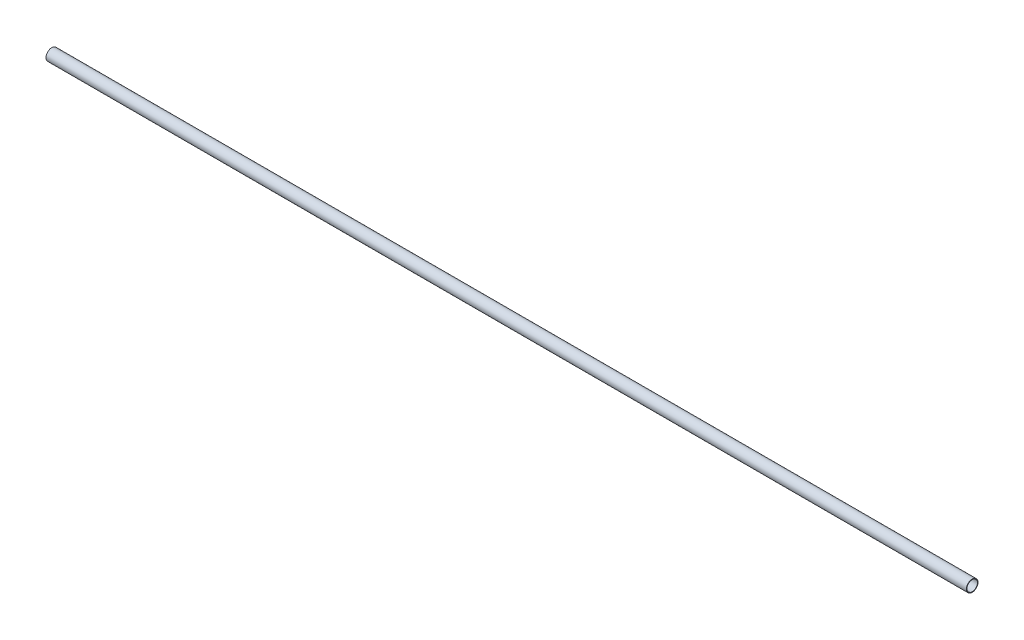
ISO-10303-21;
HEADER;
FILE_DESCRIPTION(('STEP AP214'),'2;1');
FILE_NAME('part.step','',(''),(''),'','','');
FILE_SCHEMA(('AUTOMOTIVE_DESIGN { 1 0 10303 214 1 1 1 1 }'));
ENDSEC;
DATA;
#1=APPLICATION_CONTEXT('core data for automotive mechanical design processes');
#2=APPLICATION_PROTOCOL_DEFINITION('international standard','automotive_design',2000,#1);
#3=PRODUCT_CONTEXT('',#1,'mechanical');
#4=PRODUCT('Part','Part','',(#3));
#5=PRODUCT_RELATED_PRODUCT_CATEGORY('part','',(#4));
#6=PRODUCT_DEFINITION_FORMATION('','',#4);
#7=PRODUCT_DEFINITION_CONTEXT('part definition',#1,'design');
#8=PRODUCT_DEFINITION('design','',#6,#7);
#9=PRODUCT_DEFINITION_SHAPE('','',#8);
#10=(LENGTH_UNIT() NAMED_UNIT(*) SI_UNIT(.MILLI.,.METRE.));
#11=(NAMED_UNIT(*) PLANE_ANGLE_UNIT() SI_UNIT($,.RADIAN.));
#12=(NAMED_UNIT(*) SI_UNIT($,.STERADIAN.) SOLID_ANGLE_UNIT());
#13=UNCERTAINTY_MEASURE_WITH_UNIT(LENGTH_MEASURE(1.E-05),#10,'distance_accuracy_value','');
#14=(GEOMETRIC_REPRESENTATION_CONTEXT(3) GLOBAL_UNCERTAINTY_ASSIGNED_CONTEXT((#13)) GLOBAL_UNIT_ASSIGNED_CONTEXT((#10,
#11,#12)) REPRESENTATION_CONTEXT('',''));
#15=CARTESIAN_POINT('',(0.,0.,0.));
#16=DIRECTION('',(0.,0.,1.));
#17=DIRECTION('',(1.,0.,0.));
#18=AXIS2_PLACEMENT_3D('',#15,#16,#17);
#19=CARTESIAN_POINT('',(0.,0.,0.));
#20=DIRECTION('',(1.,0.,0.));
#21=DIRECTION('',(0.,0.,-1.));
#22=AXIS2_PLACEMENT_3D('',#19,#20,#21);
#23=CYLINDRICAL_SURFACE('',#22,28.5);
#24=CARTESIAN_POINT('',(0.,0.,0.));
#25=DIRECTION('',(1.,0.,0.));
#26=DIRECTION('',(0.,0.,-1.));
#27=AXIS2_PLACEMENT_3D('',#24,#25,#26);
#28=CIRCLE('',#27,28.5);
#29=CARTESIAN_POINT('',(0.,0.,-28.5));
#30=VERTEX_POINT('',#29);
#31=EDGE_CURVE('E16',#30,#30,#28,.T.);
#32=ORIENTED_EDGE('',*,*,#31,.F.);
#33=EDGE_LOOP('',(#32));
#34=FACE_BOUND('',#33,.T.);
#35=CARTESIAN_POINT('',(5000.,0.,0.));
#36=DIRECTION('',(1.,0.,0.));
#37=DIRECTION('',(0.,0.,-1.));
#38=AXIS2_PLACEMENT_3D('',#35,#36,#37);
#39=CIRCLE('',#38,28.5);
#40=CARTESIAN_POINT('',(5000.,0.,-28.5));
#41=VERTEX_POINT('',#40);
#42=EDGE_CURVE('E25',#41,#41,#39,.F.);
#43=ORIENTED_EDGE('',*,*,#42,.F.);
#44=EDGE_LOOP('',(#43));
#45=FACE_BOUND('',#44,.T.);
#46=ADVANCED_FACE('F13',(#34,#45),#23,.F.);
#47=CARTESIAN_POINT('',(0.,-31.8780010542674,-31.5));
#48=DIRECTION('',(-1.,0.,0.));
#49=DIRECTION('',(0.,0.,1.));
#50=AXIS2_PLACEMENT_3D('',#47,#48,#49);
#51=PLANE('',#50);
#52=ORIENTED_EDGE('',*,*,#31,.T.);
#53=EDGE_LOOP('',(#52));
#54=FACE_BOUND('',#53,.T.);
#55=CARTESIAN_POINT('',(0.,0.,0.));
#56=DIRECTION('',(1.,0.,0.));
#57=DIRECTION('',(0.,0.,-1.));
#58=AXIS2_PLACEMENT_3D('',#55,#56,#57);
#59=CIRCLE('',#58,31.5);
#60=CARTESIAN_POINT('',(0.,0.,-31.5));
#61=VERTEX_POINT('',#60);
#62=EDGE_CURVE('E20',#61,#61,#59,.T.);
#63=ORIENTED_EDGE('',*,*,#62,.F.);
#64=EDGE_LOOP('',(#63));
#65=FACE_BOUND('',#64,.T.);
#66=ADVANCED_FACE('F33',(#54,#65),#51,.T.);
#67=CARTESIAN_POINT('',(5000.,-31.8780010542674,31.5));
#68=DIRECTION('',(1.,0.,0.));
#69=DIRECTION('',(0.,0.,-1.));
#70=AXIS2_PLACEMENT_3D('',#67,#68,#69);
#71=PLANE('',#70);
#72=ORIENTED_EDGE('',*,*,#42,.T.);
#73=EDGE_LOOP('',(#72));
#74=FACE_BOUND('',#73,.T.);
#75=CARTESIAN_POINT('',(5000.,0.,0.));
#76=DIRECTION('',(1.,0.,0.));
#77=DIRECTION('',(0.,0.,-1.));
#78=AXIS2_PLACEMENT_3D('',#75,#76,#77);
#79=CIRCLE('',#78,31.5);
#80=CARTESIAN_POINT('',(5000.,0.,-31.5));
#81=VERTEX_POINT('',#80);
#82=EDGE_CURVE('E8',#81,#81,#79,.F.);
#83=ORIENTED_EDGE('',*,*,#82,.F.);
#84=EDGE_LOOP('',(#83));
#85=FACE_BOUND('',#84,.T.);
#86=ADVANCED_FACE('F42',(#74,#85),#71,.T.);
#87=CARTESIAN_POINT('',(5000.,0.,0.));
#88=DIRECTION('',(1.,0.,0.));
#89=DIRECTION('',(0.,0.,-1.));
#90=AXIS2_PLACEMENT_3D('',#87,#88,#89);
#91=CYLINDRICAL_SURFACE('',#90,31.5);
#92=ORIENTED_EDGE('',*,*,#62,.T.);
#93=EDGE_LOOP('',(#92));
#94=FACE_BOUND('',#93,.T.);
#95=ORIENTED_EDGE('',*,*,#82,.T.);
#96=EDGE_LOOP('',(#95));
#97=FACE_BOUND('',#96,.T.);
#98=ADVANCED_FACE('F43',(#94,#97),#91,.T.);
#99=CLOSED_SHELL('',(#46,#66,#86,#98));
#100=MANIFOLD_SOLID_BREP('B1',#99);
#101=ADVANCED_BREP_SHAPE_REPRESENTATION('',(#18,#100),#14);
#102=SHAPE_DEFINITION_REPRESENTATION(#9,#101);
ENDSEC;
END-ISO-10303-21;
